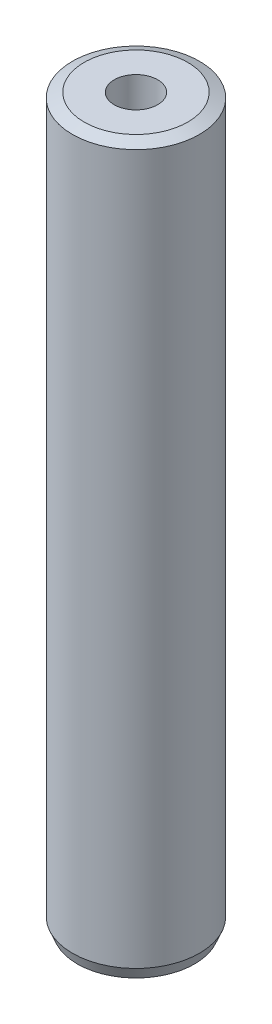
ISO-10303-21;
HEADER;
FILE_DESCRIPTION(('STEP AP214'),'2;1');
FILE_NAME('part.step','',(''),(''),'','','');
FILE_SCHEMA(('AUTOMOTIVE_DESIGN { 1 0 10303 214 1 1 1 1 }'));
ENDSEC;
DATA;
#1=APPLICATION_CONTEXT('core data for automotive mechanical design processes');
#2=APPLICATION_PROTOCOL_DEFINITION('international standard','automotive_design',2000,#1);
#3=PRODUCT_CONTEXT('',#1,'mechanical');
#4=PRODUCT('Part','Part','',(#3));
#5=PRODUCT_RELATED_PRODUCT_CATEGORY('part','',(#4));
#6=PRODUCT_DEFINITION_FORMATION('','',#4);
#7=PRODUCT_DEFINITION_CONTEXT('part definition',#1,'design');
#8=PRODUCT_DEFINITION('design','',#6,#7);
#9=PRODUCT_DEFINITION_SHAPE('','',#8);
#10=(LENGTH_UNIT() NAMED_UNIT(*) SI_UNIT(.MILLI.,.METRE.));
#11=(NAMED_UNIT(*) PLANE_ANGLE_UNIT() SI_UNIT($,.RADIAN.));
#12=(NAMED_UNIT(*) SI_UNIT($,.STERADIAN.) SOLID_ANGLE_UNIT());
#13=UNCERTAINTY_MEASURE_WITH_UNIT(LENGTH_MEASURE(1.E-05),#10,'distance_accuracy_value','');
#14=(GEOMETRIC_REPRESENTATION_CONTEXT(3) GLOBAL_UNCERTAINTY_ASSIGNED_CONTEXT((#13)) GLOBAL_UNIT_ASSIGNED_CONTEXT((#10,
#11,#12)) REPRESENTATION_CONTEXT('',''));
#15=CARTESIAN_POINT('',(0.,0.,0.));
#16=DIRECTION('',(0.,0.,1.));
#17=DIRECTION('',(1.,0.,0.));
#18=AXIS2_PLACEMENT_3D('',#15,#16,#17);
#19=CARTESIAN_POINT('',(0.,600.,0.));
#20=DIRECTION('',(0.,-1.,0.));
#21=DIRECTION('',(0.,0.,-1.));
#22=AXIS2_PLACEMENT_3D('',#19,#20,#21);
#23=CYLINDRICAL_SURFACE('',#22,52.5);
#24=CARTESIAN_POINT('',(0.,595.991687992327,0.));
#25=DIRECTION('',(0.,1.,0.));
#26=DIRECTION('',(0.,0.,1.));
#27=AXIS2_PLACEMENT_3D('',#24,#25,#26);
#28=CIRCLE('',#27,52.5);
#29=CARTESIAN_POINT('',(0.,595.991687992327,52.5));
#30=VERTEX_POINT('',#29);
#31=EDGE_CURVE('E50',#30,#30,#28,.F.);
#32=ORIENTED_EDGE('',*,*,#31,.T.);
#33=EDGE_LOOP('',(#32));
#34=FACE_BOUND('',#33,.T.);
#35=CARTESIAN_POINT('',(0.,9.68861216310624,0.));
#36=DIRECTION('',(0.,1.,0.));
#37=DIRECTION('',(0.,0.,1.));
#38=AXIS2_PLACEMENT_3D('',#35,#36,#37);
#39=CIRCLE('',#38,52.5);
#40=CARTESIAN_POINT('',(0.,9.68861216310624,52.5));
#41=VERTEX_POINT('',#40);
#42=EDGE_CURVE('E51',#41,#41,#39,.T.);
#43=ORIENTED_EDGE('',*,*,#42,.T.);
#44=EDGE_LOOP('',(#43));
#45=FACE_BOUND('',#44,.T.);
#46=ADVANCED_FACE('F39',(#34,#45),#23,.T.);
#47=CARTESIAN_POINT('',(0.,600.,0.));
#48=DIRECTION('',(0.,1.,0.));
#49=DIRECTION('',(0.,0.,1.));
#50=AXIS2_PLACEMENT_3D('',#47,#48,#49);
#51=PLANE('',#50);
#52=CARTESIAN_POINT('',(0.,600.,0.));
#53=DIRECTION('',(0.,1.,0.));
#54=DIRECTION('',(0.,0.,1.));
#55=AXIS2_PLACEMENT_3D('',#52,#53,#54);
#56=CIRCLE('',#55,42.8113878368936);
#57=CARTESIAN_POINT('',(0.,600.,42.8113878368936));
#58=VERTEX_POINT('',#57);
#59=EDGE_CURVE('E54',#58,#58,#56,.T.);
#60=ORIENTED_EDGE('',*,*,#59,.T.);
#61=EDGE_LOOP('',(#60));
#62=FACE_BOUND('',#61,.T.);
#63=CARTESIAN_POINT('',(0.,600.,0.));
#64=DIRECTION('',(0.,1.,0.));
#65=DIRECTION('',(0.,0.,1.));
#66=AXIS2_PLACEMENT_3D('',#63,#64,#65);
#67=CIRCLE('',#66,17.9358208620811);
#68=CARTESIAN_POINT('',(0.,600.,17.9358208620811));
#69=VERTEX_POINT('',#68);
#70=EDGE_CURVE('E58',#69,#69,#67,.T.);
#71=ORIENTED_EDGE('',*,*,#70,.F.);
#72=EDGE_LOOP('',(#71));
#73=FACE_BOUND('',#72,.T.);
#74=ADVANCED_FACE('F69',(#62,#73),#51,.T.);
#75=CARTESIAN_POINT('',(0.,0.,0.));
#76=DIRECTION('',(0.,1.,0.));
#77=DIRECTION('',(0.,0.,1.));
#78=AXIS2_PLACEMENT_3D('',#75,#76,#77);
#79=PLANE('',#78);
#80=CARTESIAN_POINT('',(0.,0.,0.));
#81=DIRECTION('',(0.,1.,0.));
#82=DIRECTION('',(0.,0.,1.));
#83=AXIS2_PLACEMENT_3D('',#80,#81,#82);
#84=CIRCLE('',#83,48.4916879923269);
#85=CARTESIAN_POINT('',(0.,0.,48.4916879923269));
#86=VERTEX_POINT('',#85);
#87=EDGE_CURVE('E10',#86,#86,#84,.F.);
#88=ORIENTED_EDGE('',*,*,#87,.T.);
#89=EDGE_LOOP('',(#88));
#90=FACE_BOUND('',#89,.T.);
#91=CARTESIAN_POINT('',(0.,0.,0.));
#92=DIRECTION('',(0.,1.,0.));
#93=DIRECTION('',(0.,0.,1.));
#94=AXIS2_PLACEMENT_3D('',#91,#92,#93);
#95=CIRCLE('',#94,17.9358208620811);
#96=CARTESIAN_POINT('',(0.,0.,17.9358208620811));
#97=VERTEX_POINT('',#96);
#98=EDGE_CURVE('E63',#97,#97,#95,.T.);
#99=ORIENTED_EDGE('',*,*,#98,.T.);
#100=EDGE_LOOP('',(#99));
#101=FACE_BOUND('',#100,.T.);
#102=ADVANCED_FACE('F75',(#90,#101),#79,.F.);
#103=CARTESIAN_POINT('',(0.,600.,0.));
#104=DIRECTION('',(0.,-1.,0.));
#105=DIRECTION('',(0.,0.,-1.));
#106=AXIS2_PLACEMENT_3D('',#103,#104,#105);
#107=CYLINDRICAL_SURFACE('',#106,17.9358208620811);
#108=ORIENTED_EDGE('',*,*,#70,.T.);
#109=EDGE_LOOP('',(#108));
#110=FACE_BOUND('',#109,.T.);
#111=ORIENTED_EDGE('',*,*,#98,.F.);
#112=EDGE_LOOP('',(#111));
#113=FACE_BOUND('',#112,.T.);
#114=ADVANCED_FACE('F70',(#110,#113),#107,.F.);
#115=CARTESIAN_POINT('',(0.,600.,0.));
#116=DIRECTION('',(0.,-1.,0.));
#117=DIRECTION('',(0.,0.,-1.));
#118=AXIS2_PLACEMENT_3D('',#115,#116,#117);
#119=CONICAL_SURFACE('',#118,42.8113878368936,1.17852394253568);
#120=ORIENTED_EDGE('',*,*,#31,.F.);
#121=EDGE_LOOP('',(#120));
#122=FACE_BOUND('',#121,.T.);
#123=ORIENTED_EDGE('',*,*,#59,.F.);
#124=EDGE_LOOP('',(#123));
#125=FACE_BOUND('',#124,.T.);
#126=ADVANCED_FACE('F81',(#122,#125),#119,.T.);
#127=CARTESIAN_POINT('',(0.,9.68861216310624,0.));
#128=DIRECTION('',(0.,1.,0.));
#129=DIRECTION('',(0.,0.,1.));
#130=AXIS2_PLACEMENT_3D('',#127,#128,#129);
#131=CONICAL_SURFACE('',#130,52.5,0.392272384259225);
#132=ORIENTED_EDGE('',*,*,#87,.F.);
#133=EDGE_LOOP('',(#132));
#134=FACE_BOUND('',#133,.T.);
#135=ORIENTED_EDGE('',*,*,#42,.F.);
#136=EDGE_LOOP('',(#135));
#137=FACE_BOUND('',#136,.T.);
#138=ADVANCED_FACE('F45',(#134,#137),#131,.T.);
#139=CLOSED_SHELL('',(#46,#74,#102,#114,#126,#138));
#140=MANIFOLD_SOLID_BREP('B2',#139);
#141=ADVANCED_BREP_SHAPE_REPRESENTATION('',(#18,#140),#14);
#142=SHAPE_DEFINITION_REPRESENTATION(#9,#141);
ENDSEC;
END-ISO-10303-21;
